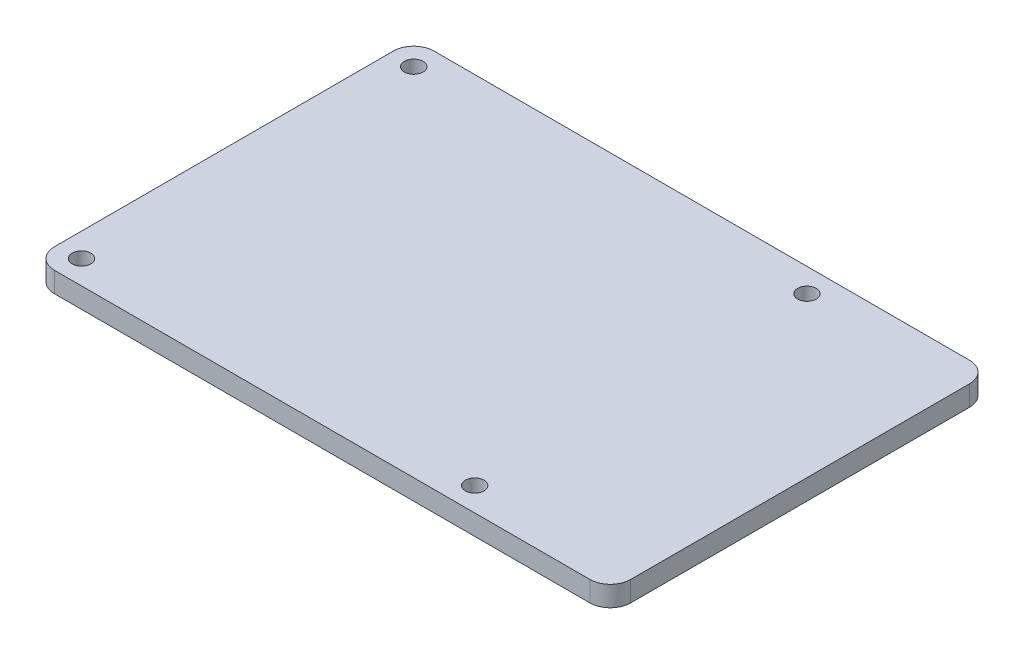
ISO-10303-21;
HEADER;
FILE_DESCRIPTION(('STEP AP214'),'2;1');
FILE_NAME('part.step','',(''),(''),'','','');
FILE_SCHEMA(('AUTOMOTIVE_DESIGN { 1 0 10303 214 1 1 1 1 }'));
ENDSEC;
DATA;
#1=APPLICATION_CONTEXT('core data for automotive mechanical design processes');
#2=APPLICATION_PROTOCOL_DEFINITION('international standard','automotive_design',2000,#1);
#3=PRODUCT_CONTEXT('',#1,'mechanical');
#4=PRODUCT('Part','Part','',(#3));
#5=PRODUCT_RELATED_PRODUCT_CATEGORY('part','',(#4));
#6=PRODUCT_DEFINITION_FORMATION('','',#4);
#7=PRODUCT_DEFINITION_CONTEXT('part definition',#1,'design');
#8=PRODUCT_DEFINITION('design','',#6,#7);
#9=PRODUCT_DEFINITION_SHAPE('','',#8);
#10=(LENGTH_UNIT() NAMED_UNIT(*) SI_UNIT(.MILLI.,.METRE.));
#11=(NAMED_UNIT(*) PLANE_ANGLE_UNIT() SI_UNIT($,.RADIAN.));
#12=(NAMED_UNIT(*) SI_UNIT($,.STERADIAN.) SOLID_ANGLE_UNIT());
#13=UNCERTAINTY_MEASURE_WITH_UNIT(LENGTH_MEASURE(1.E-05),#10,'distance_accuracy_value','');
#14=(GEOMETRIC_REPRESENTATION_CONTEXT(3) GLOBAL_UNCERTAINTY_ASSIGNED_CONTEXT((#13)) GLOBAL_UNIT_ASSIGNED_CONTEXT((#10,
#11,#12)) REPRESENTATION_CONTEXT('',''));
#15=CARTESIAN_POINT('',(0.,0.,0.));
#16=DIRECTION('',(0.,0.,1.));
#17=DIRECTION('',(1.,0.,0.));
#18=AXIS2_PLACEMENT_3D('',#15,#16,#17);
#19=CARTESIAN_POINT('',(82.,3.,-3.));
#20=DIRECTION('',(0.,1.,0.));
#21=DIRECTION('',(0.,0.,1.));
#22=AXIS2_PLACEMENT_3D('',#19,#20,#21);
#23=PLANE('',#22);
#24=CARTESIAN_POINT('',(61.5,3.,-3.5));
#25=DIRECTION('',(0.,1.,0.));
#26=DIRECTION('',(0.,0.,1.));
#27=AXIS2_PLACEMENT_3D('',#24,#25,#26);
#28=CIRCLE('',#27,1.37500000000001);
#29=CARTESIAN_POINT('',(61.5,3.,-2.12499999999999));
#30=VERTEX_POINT('',#29);
#31=EDGE_CURVE('E187',#30,#30,#28,.T.);
#32=ORIENTED_EDGE('',*,*,#31,.F.);
#33=EDGE_LOOP('',(#32));
#34=FACE_BOUND('',#33,.T.);
#35=CARTESIAN_POINT('',(3.5,3.,-52.5));
#36=DIRECTION('',(0.,1.,0.));
#37=DIRECTION('',(0.,0.,1.));
#38=AXIS2_PLACEMENT_3D('',#35,#36,#37);
#39=CIRCLE('',#38,1.375);
#40=CARTESIAN_POINT('',(3.5,3.,-51.125));
#41=VERTEX_POINT('',#40);
#42=EDGE_CURVE('E133',#41,#41,#39,.T.);
#43=ORIENTED_EDGE('',*,*,#42,.F.);
#44=EDGE_LOOP('',(#43));
#45=FACE_BOUND('',#44,.T.);
#46=CARTESIAN_POINT('',(82.,3.,-3.));
#47=DIRECTION('',(0.,1.,0.));
#48=DIRECTION('',(0.,0.,1.));
#49=AXIS2_PLACEMENT_3D('',#46,#47,#48);
#50=CIRCLE('',#49,3.);
#51=CARTESIAN_POINT('',(82.,3.,0.));
#52=VERTEX_POINT('',#51);
#53=CARTESIAN_POINT('',(85.,3.,-3.00000000000002));
#54=VERTEX_POINT('',#53);
#55=EDGE_CURVE('E144',#52,#54,#50,.T.);
#56=ORIENTED_EDGE('',*,*,#55,.T.);
#57=DIRECTION('',(0.,0.,-1.));
#58=VECTOR('',#57,1.);
#59=CARTESIAN_POINT('',(85.,3.,-3.00000000000002));
#60=LINE('',#59,#58);
#61=CARTESIAN_POINT('',(85.,3.,-53.));
#62=VERTEX_POINT('',#61);
#63=EDGE_CURVE('E92',#54,#62,#60,.T.);
#64=ORIENTED_EDGE('',*,*,#63,.T.);
#65=CARTESIAN_POINT('',(82.,3.,-53.));
#66=DIRECTION('',(0.,1.,0.));
#67=DIRECTION('',(0.,0.,-1.));
#68=AXIS2_PLACEMENT_3D('',#65,#66,#67);
#69=CIRCLE('',#68,3.);
#70=CARTESIAN_POINT('',(82.,3.,-56.));
#71=VERTEX_POINT('',#70);
#72=EDGE_CURVE('E159',#62,#71,#69,.T.);
#73=ORIENTED_EDGE('',*,*,#72,.T.);
#74=DIRECTION('',(-1.,0.,0.));
#75=VECTOR('',#74,1.);
#76=CARTESIAN_POINT('',(3.00000000000002,3.,-56.));
#77=LINE('',#76,#75);
#78=CARTESIAN_POINT('',(3.,3.,-56.));
#79=VERTEX_POINT('',#78);
#80=EDGE_CURVE('E172',#71,#79,#77,.T.);
#81=ORIENTED_EDGE('',*,*,#80,.T.);
#82=CARTESIAN_POINT('',(3.,3.,-53.));
#83=DIRECTION('',(0.,1.,0.));
#84=DIRECTION('',(0.,0.,-1.));
#85=AXIS2_PLACEMENT_3D('',#82,#83,#84);
#86=CIRCLE('',#85,3.);
#87=CARTESIAN_POINT('',(0.,3.,-53.));
#88=VERTEX_POINT('',#87);
#89=EDGE_CURVE('E111',#79,#88,#86,.T.);
#90=ORIENTED_EDGE('',*,*,#89,.T.);
#91=DIRECTION('',(0.,0.,1.));
#92=VECTOR('',#91,1.);
#93=CARTESIAN_POINT('',(0.,3.,-3.00000000000002));
#94=LINE('',#93,#92);
#95=CARTESIAN_POINT('',(0.,3.,-3.00000000000002));
#96=VERTEX_POINT('',#95);
#97=EDGE_CURVE('E105',#88,#96,#94,.T.);
#98=ORIENTED_EDGE('',*,*,#97,.T.);
#99=CARTESIAN_POINT('',(3.,3.,-3.));
#100=DIRECTION('',(0.,1.,0.));
#101=DIRECTION('',(0.,0.,-1.));
#102=AXIS2_PLACEMENT_3D('',#99,#100,#101);
#103=CIRCLE('',#102,3.);
#104=CARTESIAN_POINT('',(3.00000000000002,3.,0.));
#105=VERTEX_POINT('',#104);
#106=EDGE_CURVE('E109',#96,#105,#103,.T.);
#107=ORIENTED_EDGE('',*,*,#106,.T.);
#108=DIRECTION('',(1.,0.,0.));
#109=VECTOR('',#108,1.);
#110=CARTESIAN_POINT('',(3.00000000000002,3.,0.));
#111=LINE('',#110,#109);
#112=EDGE_CURVE('E49',#105,#52,#111,.T.);
#113=ORIENTED_EDGE('',*,*,#112,.T.);
#114=EDGE_LOOP('',(#56,#64,#73,#81,#90,#98,#107,#113));
#115=FACE_BOUND('',#114,.T.);
#116=CARTESIAN_POINT('',(3.5,3.,-3.5));
#117=DIRECTION('',(0.,1.,0.));
#118=DIRECTION('',(0.,0.,1.));
#119=AXIS2_PLACEMENT_3D('',#116,#117,#118);
#120=CIRCLE('',#119,1.375);
#121=CARTESIAN_POINT('',(3.5,3.,-2.125));
#122=VERTEX_POINT('',#121);
#123=EDGE_CURVE('E181',#122,#122,#120,.T.);
#124=ORIENTED_EDGE('',*,*,#123,.F.);
#125=EDGE_LOOP('',(#124));
#126=FACE_BOUND('',#125,.T.);
#127=CARTESIAN_POINT('',(61.5,3.,-52.5));
#128=DIRECTION('',(0.,1.,0.));
#129=DIRECTION('',(0.,0.,1.));
#130=AXIS2_PLACEMENT_3D('',#127,#128,#129);
#131=CIRCLE('',#130,1.37500000000001);
#132=CARTESIAN_POINT('',(61.5,3.,-51.125));
#133=VERTEX_POINT('',#132);
#134=EDGE_CURVE('E193',#133,#133,#131,.T.);
#135=ORIENTED_EDGE('',*,*,#134,.F.);
#136=EDGE_LOOP('',(#135));
#137=FACE_BOUND('',#136,.T.);
#138=ADVANCED_FACE('F32',(#34,#45,#115,#126,#137),#23,.T.);
#139=CARTESIAN_POINT('',(82.,0.,-3.));
#140=DIRECTION('',(0.,1.,0.));
#141=DIRECTION('',(0.,0.,1.));
#142=AXIS2_PLACEMENT_3D('',#139,#140,#141);
#143=PLANE('',#142);
#144=CARTESIAN_POINT('',(82.,0.,-3.));
#145=DIRECTION('',(0.,1.,0.));
#146=DIRECTION('',(0.,0.,1.));
#147=AXIS2_PLACEMENT_3D('',#144,#145,#146);
#148=CIRCLE('',#147,3.);
#149=CARTESIAN_POINT('',(82.,0.,0.));
#150=VERTEX_POINT('',#149);
#151=CARTESIAN_POINT('',(85.,0.,-3.00000000000002));
#152=VERTEX_POINT('',#151);
#153=EDGE_CURVE('E129',#150,#152,#148,.T.);
#154=ORIENTED_EDGE('',*,*,#153,.F.);
#155=DIRECTION('',(1.,0.,0.));
#156=VECTOR('',#155,1.);
#157=CARTESIAN_POINT('',(3.00000000000002,0.,0.));
#158=LINE('',#157,#156);
#159=CARTESIAN_POINT('',(3.00000000000002,0.,0.));
#160=VERTEX_POINT('',#159);
#161=EDGE_CURVE('E84',#160,#150,#158,.T.);
#162=ORIENTED_EDGE('',*,*,#161,.F.);
#163=CARTESIAN_POINT('',(3.,0.,-3.));
#164=DIRECTION('',(0.,1.,0.));
#165=DIRECTION('',(0.,0.,-1.));
#166=AXIS2_PLACEMENT_3D('',#163,#164,#165);
#167=CIRCLE('',#166,3.);
#168=CARTESIAN_POINT('',(0.,0.,-3.00000000000002));
#169=VERTEX_POINT('',#168);
#170=EDGE_CURVE('E78',#169,#160,#167,.T.);
#171=ORIENTED_EDGE('',*,*,#170,.F.);
#172=DIRECTION('',(0.,0.,1.));
#173=VECTOR('',#172,1.);
#174=CARTESIAN_POINT('',(0.,0.,-3.00000000000002));
#175=LINE('',#174,#173);
#176=CARTESIAN_POINT('',(0.,0.,-53.));
#177=VERTEX_POINT('',#176);
#178=EDGE_CURVE('E119',#177,#169,#175,.T.);
#179=ORIENTED_EDGE('',*,*,#178,.F.);
#180=CARTESIAN_POINT('',(3.,0.,-53.));
#181=DIRECTION('',(0.,1.,0.));
#182=DIRECTION('',(0.,0.,-1.));
#183=AXIS2_PLACEMENT_3D('',#180,#181,#182);
#184=CIRCLE('',#183,3.);
#185=CARTESIAN_POINT('',(3.,0.,-56.));
#186=VERTEX_POINT('',#185);
#187=EDGE_CURVE('E139',#186,#177,#184,.T.);
#188=ORIENTED_EDGE('',*,*,#187,.F.);
#189=DIRECTION('',(-1.,0.,0.));
#190=VECTOR('',#189,1.);
#191=CARTESIAN_POINT('',(3.00000000000002,0.,-56.));
#192=LINE('',#191,#190);
#193=CARTESIAN_POINT('',(82.,0.,-56.));
#194=VERTEX_POINT('',#193);
#195=EDGE_CURVE('E137',#194,#186,#192,.T.);
#196=ORIENTED_EDGE('',*,*,#195,.F.);
#197=CARTESIAN_POINT('',(82.,0.,-53.));
#198=DIRECTION('',(0.,1.,0.));
#199=DIRECTION('',(0.,0.,-1.));
#200=AXIS2_PLACEMENT_3D('',#197,#198,#199);
#201=CIRCLE('',#200,3.);
#202=CARTESIAN_POINT('',(85.,0.,-53.));
#203=VERTEX_POINT('',#202);
#204=EDGE_CURVE('E135',#203,#194,#201,.T.);
#205=ORIENTED_EDGE('',*,*,#204,.F.);
#206=DIRECTION('',(0.,0.,-1.));
#207=VECTOR('',#206,1.);
#208=CARTESIAN_POINT('',(85.,0.,-3.00000000000002));
#209=LINE('',#208,#207);
#210=EDGE_CURVE('E132',#152,#203,#209,.T.);
#211=ORIENTED_EDGE('',*,*,#210,.F.);
#212=EDGE_LOOP('',(#154,#162,#171,#179,#188,#196,#205,#211));
#213=FACE_BOUND('',#212,.T.);
#214=CARTESIAN_POINT('',(3.5,0.,-52.5));
#215=DIRECTION('',(0.,1.,0.));
#216=DIRECTION('',(0.,0.,1.));
#217=AXIS2_PLACEMENT_3D('',#214,#215,#216);
#218=CIRCLE('',#217,1.375);
#219=CARTESIAN_POINT('',(3.5,0.,-51.125));
#220=VERTEX_POINT('',#219);
#221=EDGE_CURVE('E178',#220,#220,#218,.T.);
#222=ORIENTED_EDGE('',*,*,#221,.T.);
#223=EDGE_LOOP('',(#222));
#224=FACE_BOUND('',#223,.T.);
#225=CARTESIAN_POINT('',(3.5,0.,-3.5));
#226=DIRECTION('',(0.,1.,0.));
#227=DIRECTION('',(0.,0.,1.));
#228=AXIS2_PLACEMENT_3D('',#225,#226,#227);
#229=CIRCLE('',#228,1.375);
#230=CARTESIAN_POINT('',(3.5,0.,-2.125));
#231=VERTEX_POINT('',#230);
#232=EDGE_CURVE('E184',#231,#231,#229,.T.);
#233=ORIENTED_EDGE('',*,*,#232,.T.);
#234=EDGE_LOOP('',(#233));
#235=FACE_BOUND('',#234,.T.);
#236=CARTESIAN_POINT('',(61.5,0.,-3.5));
#237=DIRECTION('',(0.,1.,0.));
#238=DIRECTION('',(0.,0.,1.));
#239=AXIS2_PLACEMENT_3D('',#236,#237,#238);
#240=CIRCLE('',#239,1.37500000000001);
#241=CARTESIAN_POINT('',(61.5,0.,-2.12499999999999));
#242=VERTEX_POINT('',#241);
#243=EDGE_CURVE('E190',#242,#242,#240,.T.);
#244=ORIENTED_EDGE('',*,*,#243,.T.);
#245=EDGE_LOOP('',(#244));
#246=FACE_BOUND('',#245,.T.);
#247=CARTESIAN_POINT('',(61.5,0.,-52.5));
#248=DIRECTION('',(0.,1.,0.));
#249=DIRECTION('',(0.,0.,1.));
#250=AXIS2_PLACEMENT_3D('',#247,#248,#249);
#251=CIRCLE('',#250,1.37500000000001);
#252=CARTESIAN_POINT('',(61.5,0.,-51.125));
#253=VERTEX_POINT('',#252);
#254=EDGE_CURVE('E196',#253,#253,#251,.T.);
#255=ORIENTED_EDGE('',*,*,#254,.T.);
#256=EDGE_LOOP('',(#255));
#257=FACE_BOUND('',#256,.T.);
#258=ADVANCED_FACE('F163',(#213,#224,#235,#246,#257),#143,.F.);
#259=CARTESIAN_POINT('',(82.,3.,-3.));
#260=DIRECTION('',(0.,-1.,0.));
#261=DIRECTION('',(0.,0.,-1.));
#262=AXIS2_PLACEMENT_3D('',#259,#260,#261);
#263=CYLINDRICAL_SURFACE('',#262,3.);
#264=ORIENTED_EDGE('',*,*,#153,.T.);
#265=DIRECTION('',(0.,-1.,0.));
#266=VECTOR('',#265,1.);
#267=CARTESIAN_POINT('',(85.,3.,-3.00000000000002));
#268=LINE('',#267,#266);
#269=EDGE_CURVE('E11',#54,#152,#268,.T.);
#270=ORIENTED_EDGE('',*,*,#269,.F.);
#271=ORIENTED_EDGE('',*,*,#55,.F.);
#272=DIRECTION('',(0.,-1.,0.));
#273=VECTOR('',#272,1.);
#274=CARTESIAN_POINT('',(82.,3.,0.));
#275=LINE('',#274,#273);
#276=EDGE_CURVE('E125',#52,#150,#275,.T.);
#277=ORIENTED_EDGE('',*,*,#276,.T.);
#278=EDGE_LOOP('',(#264,#270,#271,#277));
#279=FACE_BOUND('',#278,.T.);
#280=ADVANCED_FACE('F34',(#279),#263,.T.);
#281=CARTESIAN_POINT('',(85.,3.,-3.00000000000002));
#282=DIRECTION('',(-1.,0.,0.));
#283=DIRECTION('',(0.,0.,1.));
#284=AXIS2_PLACEMENT_3D('',#281,#282,#283);
#285=PLANE('',#284);
#286=ORIENTED_EDGE('',*,*,#210,.T.);
#287=DIRECTION('',(0.,-1.,0.));
#288=VECTOR('',#287,1.);
#289=CARTESIAN_POINT('',(85.,3.,-53.));
#290=LINE('',#289,#288);
#291=EDGE_CURVE('E41',#62,#203,#290,.T.);
#292=ORIENTED_EDGE('',*,*,#291,.F.);
#293=ORIENTED_EDGE('',*,*,#63,.F.);
#294=ORIENTED_EDGE('',*,*,#269,.T.);
#295=EDGE_LOOP('',(#286,#292,#293,#294));
#296=FACE_BOUND('',#295,.T.);
#297=ADVANCED_FACE('F230',(#296),#285,.F.);
#298=CARTESIAN_POINT('',(82.,3.,-53.));
#299=DIRECTION('',(0.,-1.,0.));
#300=DIRECTION('',(0.,0.,-1.));
#301=AXIS2_PLACEMENT_3D('',#298,#299,#300);
#302=CYLINDRICAL_SURFACE('',#301,3.);
#303=ORIENTED_EDGE('',*,*,#204,.T.);
#304=DIRECTION('',(0.,-1.,0.));
#305=VECTOR('',#304,1.);
#306=CARTESIAN_POINT('',(82.,3.,-56.));
#307=LINE('',#306,#305);
#308=EDGE_CURVE('E151',#71,#194,#307,.T.);
#309=ORIENTED_EDGE('',*,*,#308,.F.);
#310=ORIENTED_EDGE('',*,*,#72,.F.);
#311=ORIENTED_EDGE('',*,*,#291,.T.);
#312=EDGE_LOOP('',(#303,#309,#310,#311));
#313=FACE_BOUND('',#312,.T.);
#314=ADVANCED_FACE('F157',(#313),#302,.T.);
#315=CARTESIAN_POINT('',(3.00000000000002,3.,-56.));
#316=DIRECTION('',(0.,0.,1.));
#317=DIRECTION('',(1.,0.,0.));
#318=AXIS2_PLACEMENT_3D('',#315,#316,#317);
#319=PLANE('',#318);
#320=ORIENTED_EDGE('',*,*,#195,.T.);
#321=DIRECTION('',(0.,-1.,0.));
#322=VECTOR('',#321,1.);
#323=CARTESIAN_POINT('',(3.,3.,-56.));
#324=LINE('',#323,#322);
#325=EDGE_CURVE('E148',#79,#186,#324,.T.);
#326=ORIENTED_EDGE('',*,*,#325,.F.);
#327=ORIENTED_EDGE('',*,*,#80,.F.);
#328=ORIENTED_EDGE('',*,*,#308,.T.);
#329=EDGE_LOOP('',(#320,#326,#327,#328));
#330=FACE_BOUND('',#329,.T.);
#331=ADVANCED_FACE('F168',(#330),#319,.F.);
#332=CARTESIAN_POINT('',(3.,3.,-53.));
#333=DIRECTION('',(0.,-1.,0.));
#334=DIRECTION('',(0.,0.,-1.));
#335=AXIS2_PLACEMENT_3D('',#332,#333,#334);
#336=CYLINDRICAL_SURFACE('',#335,3.);
#337=ORIENTED_EDGE('',*,*,#187,.T.);
#338=DIRECTION('',(0.,-1.,0.));
#339=VECTOR('',#338,1.);
#340=CARTESIAN_POINT('',(0.,3.,-53.));
#341=LINE('',#340,#339);
#342=EDGE_CURVE('E120',#88,#177,#341,.T.);
#343=ORIENTED_EDGE('',*,*,#342,.F.);
#344=ORIENTED_EDGE('',*,*,#89,.F.);
#345=ORIENTED_EDGE('',*,*,#325,.T.);
#346=EDGE_LOOP('',(#337,#343,#344,#345));
#347=FACE_BOUND('',#346,.T.);
#348=ADVANCED_FACE('F171',(#347),#336,.T.);
#349=CARTESIAN_POINT('',(0.,3.,-3.00000000000002));
#350=DIRECTION('',(1.,0.,0.));
#351=DIRECTION('',(0.,0.,-1.));
#352=AXIS2_PLACEMENT_3D('',#349,#350,#351);
#353=PLANE('',#352);
#354=ORIENTED_EDGE('',*,*,#178,.T.);
#355=DIRECTION('',(0.,-1.,0.));
#356=VECTOR('',#355,1.);
#357=CARTESIAN_POINT('',(0.,3.,-3.00000000000002));
#358=LINE('',#357,#356);
#359=EDGE_CURVE('E116',#96,#169,#358,.T.);
#360=ORIENTED_EDGE('',*,*,#359,.F.);
#361=ORIENTED_EDGE('',*,*,#97,.F.);
#362=ORIENTED_EDGE('',*,*,#342,.T.);
#363=EDGE_LOOP('',(#354,#360,#361,#362));
#364=FACE_BOUND('',#363,.T.);
#365=ADVANCED_FACE('F117',(#364),#353,.F.);
#366=CARTESIAN_POINT('',(3.,3.,-3.));
#367=DIRECTION('',(0.,-1.,0.));
#368=DIRECTION('',(0.,0.,-1.));
#369=AXIS2_PLACEMENT_3D('',#366,#367,#368);
#370=CYLINDRICAL_SURFACE('',#369,3.);
#371=ORIENTED_EDGE('',*,*,#170,.T.);
#372=DIRECTION('',(0.,-1.,0.));
#373=VECTOR('',#372,1.);
#374=CARTESIAN_POINT('',(3.00000000000002,3.,0.));
#375=LINE('',#374,#373);
#376=EDGE_CURVE('E121',#105,#160,#375,.T.);
#377=ORIENTED_EDGE('',*,*,#376,.F.);
#378=ORIENTED_EDGE('',*,*,#106,.F.);
#379=ORIENTED_EDGE('',*,*,#359,.T.);
#380=EDGE_LOOP('',(#371,#377,#378,#379));
#381=FACE_BOUND('',#380,.T.);
#382=ADVANCED_FACE('F123',(#381),#370,.T.);
#383=CARTESIAN_POINT('',(3.00000000000002,3.,0.));
#384=DIRECTION('',(0.,0.,-1.));
#385=DIRECTION('',(-1.,0.,0.));
#386=AXIS2_PLACEMENT_3D('',#383,#384,#385);
#387=PLANE('',#386);
#388=ORIENTED_EDGE('',*,*,#161,.T.);
#389=ORIENTED_EDGE('',*,*,#276,.F.);
#390=ORIENTED_EDGE('',*,*,#112,.F.);
#391=ORIENTED_EDGE('',*,*,#376,.T.);
#392=EDGE_LOOP('',(#388,#389,#390,#391));
#393=FACE_BOUND('',#392,.T.);
#394=ADVANCED_FACE('F218',(#393),#387,.F.);
#395=CARTESIAN_POINT('',(3.5,3.,-52.5));
#396=DIRECTION('',(0.,-1.,0.));
#397=DIRECTION('',(0.,0.,-1.));
#398=AXIS2_PLACEMENT_3D('',#395,#396,#397);
#399=CYLINDRICAL_SURFACE('',#398,1.375);
#400=ORIENTED_EDGE('',*,*,#42,.T.);
#401=EDGE_LOOP('',(#400));
#402=FACE_BOUND('',#401,.T.);
#403=ORIENTED_EDGE('',*,*,#221,.F.);
#404=EDGE_LOOP('',(#403));
#405=FACE_BOUND('',#404,.T.);
#406=ADVANCED_FACE('F215',(#402,#405),#399,.F.);
#407=CARTESIAN_POINT('',(3.5,3.,-3.5));
#408=DIRECTION('',(0.,-1.,0.));
#409=DIRECTION('',(0.,0.,-1.));
#410=AXIS2_PLACEMENT_3D('',#407,#408,#409);
#411=CYLINDRICAL_SURFACE('',#410,1.375);
#412=ORIENTED_EDGE('',*,*,#123,.T.);
#413=EDGE_LOOP('',(#412));
#414=FACE_BOUND('',#413,.T.);
#415=ORIENTED_EDGE('',*,*,#232,.F.);
#416=EDGE_LOOP('',(#415));
#417=FACE_BOUND('',#416,.T.);
#418=ADVANCED_FACE('F294',(#414,#417),#411,.F.);
#419=CARTESIAN_POINT('',(61.5,3.,-3.5));
#420=DIRECTION('',(0.,-1.,0.));
#421=DIRECTION('',(0.,0.,-1.));
#422=AXIS2_PLACEMENT_3D('',#419,#420,#421);
#423=CYLINDRICAL_SURFACE('',#422,1.37500000000001);
#424=ORIENTED_EDGE('',*,*,#31,.T.);
#425=EDGE_LOOP('',(#424));
#426=FACE_BOUND('',#425,.T.);
#427=ORIENTED_EDGE('',*,*,#243,.F.);
#428=EDGE_LOOP('',(#427));
#429=FACE_BOUND('',#428,.T.);
#430=ADVANCED_FACE('F302',(#426,#429),#423,.F.);
#431=CARTESIAN_POINT('',(61.5,3.,-52.5));
#432=DIRECTION('',(0.,-1.,0.));
#433=DIRECTION('',(0.,0.,-1.));
#434=AXIS2_PLACEMENT_3D('',#431,#432,#433);
#435=CYLINDRICAL_SURFACE('',#434,1.37500000000001);
#436=ORIENTED_EDGE('',*,*,#134,.T.);
#437=EDGE_LOOP('',(#436));
#438=FACE_BOUND('',#437,.T.);
#439=ORIENTED_EDGE('',*,*,#254,.F.);
#440=EDGE_LOOP('',(#439));
#441=FACE_BOUND('',#440,.T.);
#442=ADVANCED_FACE('F202',(#438,#441),#435,.F.);
#443=CLOSED_SHELL('',(#138,#258,#280,#297,#314,#331,#348,#365,#382,#394,#406,#418,#430,#442));
#444=MANIFOLD_SOLID_BREP('B2',#443);
#445=ADVANCED_BREP_SHAPE_REPRESENTATION('',(#18,#444),#14);
#446=SHAPE_DEFINITION_REPRESENTATION(#9,#445);
ENDSEC;
END-ISO-10303-21;
